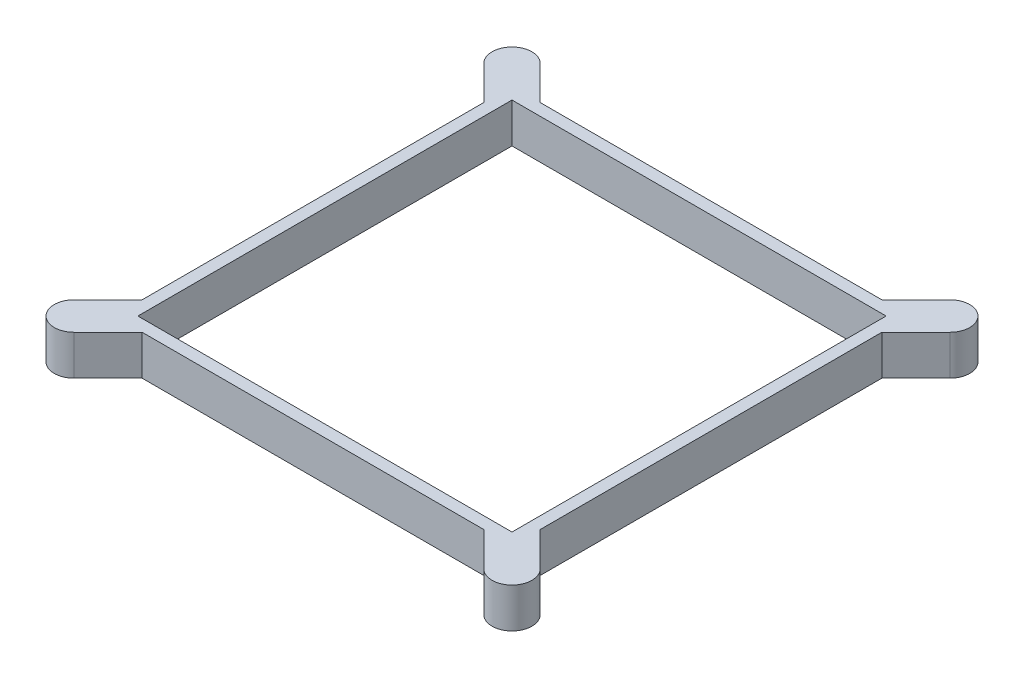
ISO-10303-21;
HEADER;
FILE_DESCRIPTION(('STEP AP214'),'2;1');
FILE_NAME('part.step','',(''),(''),'','','');
FILE_SCHEMA(('AUTOMOTIVE_DESIGN { 1 0 10303 214 1 1 1 1 }'));
ENDSEC;
DATA;
#1=APPLICATION_CONTEXT('core data for automotive mechanical design processes');
#2=APPLICATION_PROTOCOL_DEFINITION('international standard','automotive_design',2000,#1);
#3=PRODUCT_CONTEXT('',#1,'mechanical');
#4=PRODUCT('Part','Part','',(#3));
#5=PRODUCT_RELATED_PRODUCT_CATEGORY('part','',(#4));
#6=PRODUCT_DEFINITION_FORMATION('','',#4);
#7=PRODUCT_DEFINITION_CONTEXT('part definition',#1,'design');
#8=PRODUCT_DEFINITION('design','',#6,#7);
#9=PRODUCT_DEFINITION_SHAPE('','',#8);
#10=(LENGTH_UNIT() NAMED_UNIT(*) SI_UNIT(.MILLI.,.METRE.));
#11=(NAMED_UNIT(*) PLANE_ANGLE_UNIT() SI_UNIT($,.RADIAN.));
#12=(NAMED_UNIT(*) SI_UNIT($,.STERADIAN.) SOLID_ANGLE_UNIT());
#13=UNCERTAINTY_MEASURE_WITH_UNIT(LENGTH_MEASURE(1.E-05),#10,'distance_accuracy_value','');
#14=(GEOMETRIC_REPRESENTATION_CONTEXT(3) GLOBAL_UNCERTAINTY_ASSIGNED_CONTEXT((#13)) GLOBAL_UNIT_ASSIGNED_CONTEXT((#10,
#11,#12)) REPRESENTATION_CONTEXT('',''));
#15=CARTESIAN_POINT('',(0.,0.,0.));
#16=DIRECTION('',(0.,0.,1.));
#17=DIRECTION('',(1.,0.,0.));
#18=AXIS2_PLACEMENT_3D('',#15,#16,#17);
#19=CARTESIAN_POINT('',(200.,20.,0.));
#20=DIRECTION('',(-1.,0.,0.));
#21=DIRECTION('',(0.,0.,1.));
#22=AXIS2_PLACEMENT_3D('',#19,#20,#21);
#23=PLANE('',#22);
#24=DIRECTION('',(0.,-1.,0.));
#25=VECTOR('',#24,1.);
#26=CARTESIAN_POINT('',(200.,68.3076870304613,-185.857864376269));
#27=LINE('',#26,#25);
#28=CARTESIAN_POINT('',(200.,20.,-185.857864376269));
#29=VERTEX_POINT('',#28);
#30=CARTESIAN_POINT('',(200.,0.,-185.857864376269));
#31=VERTEX_POINT('',#30);
#32=EDGE_CURVE('E310',#29,#31,#27,.T.);
#33=ORIENTED_EDGE('',*,*,#32,.F.);
#34=DIRECTION('',(0.,0.,-1.));
#35=VECTOR('',#34,1.);
#36=CARTESIAN_POINT('',(200.,20.,0.));
#37=LINE('',#36,#35);
#38=CARTESIAN_POINT('',(200.,20.,-14.142135623731));
#39=VERTEX_POINT('',#38);
#40=EDGE_CURVE('E72',#39,#29,#37,.T.);
#41=ORIENTED_EDGE('',*,*,#40,.F.);
#42=DIRECTION('',(0.,-1.,0.));
#43=VECTOR('',#42,1.);
#44=CARTESIAN_POINT('',(200.,68.3076870304613,-14.142135623731));
#45=LINE('',#44,#43);
#46=CARTESIAN_POINT('',(200.,0.,-14.142135623731));
#47=VERTEX_POINT('',#46);
#48=EDGE_CURVE('E345',#39,#47,#45,.T.);
#49=ORIENTED_EDGE('',*,*,#48,.T.);
#50=DIRECTION('',(0.,0.,-1.));
#51=VECTOR('',#50,1.);
#52=CARTESIAN_POINT('',(200.,0.,0.));
#53=LINE('',#52,#51);
#54=EDGE_CURVE('E402',#47,#31,#53,.T.);
#55=ORIENTED_EDGE('',*,*,#54,.T.);
#56=EDGE_LOOP('',(#33,#41,#49,#55));
#57=FACE_BOUND('',#56,.T.);
#58=ADVANCED_FACE('F63',(#57),#23,.F.);
#59=CARTESIAN_POINT('',(0.,20.,-200.));
#60=DIRECTION('',(0.,0.,1.));
#61=DIRECTION('',(1.,0.,0.));
#62=AXIS2_PLACEMENT_3D('',#59,#60,#61);
#63=PLANE('',#62);
#64=DIRECTION('',(-1.,0.,0.));
#65=VECTOR('',#64,1.);
#66=CARTESIAN_POINT('',(0.,0.,-200.));
#67=LINE('',#66,#65);
#68=CARTESIAN_POINT('',(185.857864376269,0.,-200.));
#69=VERTEX_POINT('',#68);
#70=CARTESIAN_POINT('',(14.1421356237309,0.,-200.));
#71=VERTEX_POINT('',#70);
#72=EDGE_CURVE('E67',#69,#71,#67,.T.);
#73=ORIENTED_EDGE('',*,*,#72,.T.);
#74=DIRECTION('',(0.,-1.,0.));
#75=VECTOR('',#74,1.);
#76=CARTESIAN_POINT('',(14.142135623731,68.3076870304613,-200.));
#77=LINE('',#76,#75);
#78=CARTESIAN_POINT('',(14.1421356237309,20.,-200.));
#79=VERTEX_POINT('',#78);
#80=EDGE_CURVE('E270',#79,#71,#77,.T.);
#81=ORIENTED_EDGE('',*,*,#80,.F.);
#82=DIRECTION('',(-1.,0.,0.));
#83=VECTOR('',#82,1.);
#84=CARTESIAN_POINT('',(0.,20.,-200.));
#85=LINE('',#84,#83);
#86=CARTESIAN_POINT('',(185.857864376269,20.,-200.));
#87=VERTEX_POINT('',#86);
#88=EDGE_CURVE('E12',#87,#79,#85,.T.);
#89=ORIENTED_EDGE('',*,*,#88,.F.);
#90=DIRECTION('',(0.,-1.,0.));
#91=VECTOR('',#90,1.);
#92=CARTESIAN_POINT('',(185.857864376269,68.3076870304613,-200.));
#93=LINE('',#92,#91);
#94=EDGE_CURVE('E307',#87,#69,#93,.T.);
#95=ORIENTED_EDGE('',*,*,#94,.T.);
#96=EDGE_LOOP('',(#73,#81,#89,#95));
#97=FACE_BOUND('',#96,.T.);
#98=ADVANCED_FACE('F406',(#97),#63,.F.);
#99=CARTESIAN_POINT('',(0.,20.,0.));
#100=DIRECTION('',(1.,0.,0.));
#101=DIRECTION('',(0.,0.,-1.));
#102=AXIS2_PLACEMENT_3D('',#99,#100,#101);
#103=PLANE('',#102);
#104=DIRECTION('',(0.,0.,1.));
#105=VECTOR('',#104,1.);
#106=CARTESIAN_POINT('',(0.,20.,0.));
#107=LINE('',#106,#105);
#108=CARTESIAN_POINT('',(0.,20.,-185.857864376269));
#109=VERTEX_POINT('',#108);
#110=CARTESIAN_POINT('',(0.,20.,-14.142135623731));
#111=VERTEX_POINT('',#110);
#112=EDGE_CURVE('E393',#109,#111,#107,.T.);
#113=ORIENTED_EDGE('',*,*,#112,.F.);
#114=DIRECTION('',(0.,-1.,0.));
#115=VECTOR('',#114,1.);
#116=CARTESIAN_POINT('',(0.,68.3076870304613,-185.857864376269));
#117=LINE('',#116,#115);
#118=CARTESIAN_POINT('',(0.,0.,-185.857864376269));
#119=VERTEX_POINT('',#118);
#120=EDGE_CURVE('E268',#109,#119,#117,.T.);
#121=ORIENTED_EDGE('',*,*,#120,.T.);
#122=DIRECTION('',(0.,0.,1.));
#123=VECTOR('',#122,1.);
#124=CARTESIAN_POINT('',(0.,0.,0.));
#125=LINE('',#124,#123);
#126=CARTESIAN_POINT('',(0.,0.,-14.142135623731));
#127=VERTEX_POINT('',#126);
#128=EDGE_CURVE('E372',#119,#127,#125,.T.);
#129=ORIENTED_EDGE('',*,*,#128,.T.);
#130=DIRECTION('',(0.,-1.,0.));
#131=VECTOR('',#130,1.);
#132=CARTESIAN_POINT('',(0.,68.3076870304613,-14.142135623731));
#133=LINE('',#132,#131);
#134=EDGE_CURVE('E387',#111,#127,#133,.T.);
#135=ORIENTED_EDGE('',*,*,#134,.F.);
#136=EDGE_LOOP('',(#113,#121,#129,#135));
#137=FACE_BOUND('',#136,.T.);
#138=ADVANCED_FACE('F65',(#137),#103,.F.);
#139=CARTESIAN_POINT('',(0.,20.,0.));
#140=DIRECTION('',(0.,0.,-1.));
#141=DIRECTION('',(-1.,0.,0.));
#142=AXIS2_PLACEMENT_3D('',#139,#140,#141);
#143=PLANE('',#142);
#144=DIRECTION('',(1.,0.,0.));
#145=VECTOR('',#144,1.);
#146=CARTESIAN_POINT('',(0.,0.,0.));
#147=LINE('',#146,#145);
#148=CARTESIAN_POINT('',(14.142135623731,0.,0.));
#149=VERTEX_POINT('',#148);
#150=CARTESIAN_POINT('',(185.857864376269,0.,0.));
#151=VERTEX_POINT('',#150);
#152=EDGE_CURVE('E401',#149,#151,#147,.T.);
#153=ORIENTED_EDGE('',*,*,#152,.T.);
#154=DIRECTION('',(0.,-1.,0.));
#155=VECTOR('',#154,1.);
#156=CARTESIAN_POINT('',(185.857864376269,68.3076870304613,0.));
#157=LINE('',#156,#155);
#158=CARTESIAN_POINT('',(185.857864376269,20.,0.));
#159=VERTEX_POINT('',#158);
#160=EDGE_CURVE('E347',#159,#151,#157,.T.);
#161=ORIENTED_EDGE('',*,*,#160,.F.);
#162=DIRECTION('',(1.,0.,0.));
#163=VECTOR('',#162,1.);
#164=CARTESIAN_POINT('',(0.,20.,0.));
#165=LINE('',#164,#163);
#166=CARTESIAN_POINT('',(14.142135623731,20.,0.));
#167=VERTEX_POINT('',#166);
#168=EDGE_CURVE('E395',#167,#159,#165,.T.);
#169=ORIENTED_EDGE('',*,*,#168,.F.);
#170=DIRECTION('',(0.,-1.,0.));
#171=VECTOR('',#170,1.);
#172=CARTESIAN_POINT('',(14.142135623731,68.3076870304613,0.));
#173=LINE('',#172,#171);
#174=EDGE_CURVE('E384',#167,#149,#173,.T.);
#175=ORIENTED_EDGE('',*,*,#174,.T.);
#176=EDGE_LOOP('',(#153,#161,#169,#175));
#177=FACE_BOUND('',#176,.T.);
#178=ADVANCED_FACE('F488',(#177),#143,.F.);
#179=CARTESIAN_POINT('',(0.,20.,0.));
#180=DIRECTION('',(0.,-1.,0.));
#181=DIRECTION('',(0.,0.,-1.));
#182=AXIS2_PLACEMENT_3D('',#179,#180,#181);
#183=PLANE('',#182);
#184=DIRECTION('',(1.,0.,0.));
#185=VECTOR('',#184,1.);
#186=CARTESIAN_POINT('',(5.99999999999999,20.,-194.));
#187=LINE('',#186,#185);
#188=CARTESIAN_POINT('',(5.99999999999999,20.,-194.));
#189=VERTEX_POINT('',#188);
#190=CARTESIAN_POINT('',(194.,20.,-194.));
#191=VERTEX_POINT('',#190);
#192=EDGE_CURVE('E210',#189,#191,#187,.T.);
#193=ORIENTED_EDGE('',*,*,#192,.T.);
#194=DIRECTION('',(0.,0.,1.));
#195=VECTOR('',#194,1.);
#196=CARTESIAN_POINT('',(194.,20.,-194.));
#197=LINE('',#196,#195);
#198=CARTESIAN_POINT('',(194.,20.,-6.));
#199=VERTEX_POINT('',#198);
#200=EDGE_CURVE('E204',#191,#199,#197,.T.);
#201=ORIENTED_EDGE('',*,*,#200,.T.);
#202=DIRECTION('',(-1.,0.,0.));
#203=VECTOR('',#202,1.);
#204=CARTESIAN_POINT('',(6.,20.,-6.));
#205=LINE('',#204,#203);
#206=CARTESIAN_POINT('',(6.,20.,-6.));
#207=VERTEX_POINT('',#206);
#208=EDGE_CURVE('E213',#199,#207,#205,.T.);
#209=ORIENTED_EDGE('',*,*,#208,.T.);
#210=DIRECTION('',(0.,0.,-1.));
#211=VECTOR('',#210,1.);
#212=CARTESIAN_POINT('',(5.99999999999999,20.,-194.));
#213=LINE('',#212,#211);
#214=EDGE_CURVE('E80',#207,#189,#213,.T.);
#215=ORIENTED_EDGE('',*,*,#214,.T.);
#216=EDGE_LOOP('',(#193,#201,#209,#215));
#217=FACE_BOUND('',#216,.T.);
#218=DIRECTION('',(0.707106781186547,0.,0.707106781186548));
#219=VECTOR('',#218,1.);
#220=CARTESIAN_POINT('',(-7.07106781186548,20.,-192.928932188135));
#221=LINE('',#220,#219);
#222=CARTESIAN_POINT('',(-17.0876252708111,20.,-202.94548964708));
#223=VERTEX_POINT('',#222);
#224=EDGE_CURVE('E251',#223,#109,#221,.T.);
#225=ORIENTED_EDGE('',*,*,#224,.T.);
#226=ORIENTED_EDGE('',*,*,#112,.T.);
#227=DIRECTION('',(0.707106781186547,0.,-0.707106781186548));
#228=VECTOR('',#227,1.);
#229=CARTESIAN_POINT('',(-7.07106781186548,20.,-7.07106781186547));
#230=LINE('',#229,#228);
#231=CARTESIAN_POINT('',(-17.0876252708111,20.,2.94548964708019));
#232=VERTEX_POINT('',#231);
#233=EDGE_CURVE('E369',#232,#111,#230,.T.);
#234=ORIENTED_EDGE('',*,*,#233,.F.);
#235=CARTESIAN_POINT('',(-10.0165574589457,20.,10.0165574589457));
#236=DIRECTION('',(0.,-1.,0.));
#237=DIRECTION('',(0.,0.,-1.));
#238=AXIS2_PLACEMENT_3D('',#235,#236,#237);
#239=CIRCLE('',#238,10.);
#240=CARTESIAN_POINT('',(-2.9454896470802,20.,17.0876252708111));
#241=VERTEX_POINT('',#240);
#242=EDGE_CURVE('E368',#241,#232,#239,.T.);
#243=ORIENTED_EDGE('',*,*,#242,.F.);
#244=DIRECTION('',(-0.707106781186548,0.,0.707106781186547));
#245=VECTOR('',#244,1.);
#246=CARTESIAN_POINT('',(7.07106781186548,20.,7.07106781186548));
#247=LINE('',#246,#245);
#248=EDGE_CURVE('E365',#167,#241,#247,.T.);
#249=ORIENTED_EDGE('',*,*,#248,.F.);
#250=ORIENTED_EDGE('',*,*,#168,.T.);
#251=DIRECTION('',(0.707106781186548,0.,0.707106781186547));
#252=VECTOR('',#251,1.);
#253=CARTESIAN_POINT('',(192.928932188135,20.,7.07106781186548));
#254=LINE('',#253,#252);
#255=CARTESIAN_POINT('',(202.94548964708,20.,17.0876252708111));
#256=VERTEX_POINT('',#255);
#257=EDGE_CURVE('E334',#159,#256,#254,.T.);
#258=ORIENTED_EDGE('',*,*,#257,.T.);
#259=CARTESIAN_POINT('',(210.016557458946,20.,10.0165574589457));
#260=DIRECTION('',(0.,-1.,0.));
#261=DIRECTION('',(0.,0.,-1.));
#262=AXIS2_PLACEMENT_3D('',#259,#260,#261);
#263=CIRCLE('',#262,10.);
#264=CARTESIAN_POINT('',(217.087625270811,20.,2.94548964708019));
#265=VERTEX_POINT('',#264);
#266=EDGE_CURVE('E331',#256,#265,#263,.F.);
#267=ORIENTED_EDGE('',*,*,#266,.T.);
#268=DIRECTION('',(-0.707106781186547,0.,-0.707106781186548));
#269=VECTOR('',#268,1.);
#270=CARTESIAN_POINT('',(207.071067811865,20.,-7.07106781186547));
#271=LINE('',#270,#269);
#272=EDGE_CURVE('E328',#265,#39,#271,.T.);
#273=ORIENTED_EDGE('',*,*,#272,.T.);
#274=ORIENTED_EDGE('',*,*,#40,.T.);
#275=DIRECTION('',(-0.707106781186547,0.,0.707106781186548));
#276=VECTOR('',#275,1.);
#277=CARTESIAN_POINT('',(207.071067811865,20.,-192.928932188135));
#278=LINE('',#277,#276);
#279=CARTESIAN_POINT('',(217.087625270811,20.,-202.94548964708));
#280=VERTEX_POINT('',#279);
#281=EDGE_CURVE('E292',#280,#29,#278,.T.);
#282=ORIENTED_EDGE('',*,*,#281,.F.);
#283=CARTESIAN_POINT('',(210.016557458946,20.,-210.016557458946));
#284=DIRECTION('',(0.,-1.,0.));
#285=DIRECTION('',(0.,0.,-1.));
#286=AXIS2_PLACEMENT_3D('',#283,#284,#285);
#287=CIRCLE('',#286,10.);
#288=CARTESIAN_POINT('',(202.94548964708,20.,-217.087625270811));
#289=VERTEX_POINT('',#288);
#290=EDGE_CURVE('E291',#289,#280,#287,.T.);
#291=ORIENTED_EDGE('',*,*,#290,.F.);
#292=DIRECTION('',(0.707106781186548,0.,-0.707106781186547));
#293=VECTOR('',#292,1.);
#294=CARTESIAN_POINT('',(192.928932188135,20.,-207.071067811865));
#295=LINE('',#294,#293);
#296=EDGE_CURVE('E288',#87,#289,#295,.T.);
#297=ORIENTED_EDGE('',*,*,#296,.F.);
#298=ORIENTED_EDGE('',*,*,#88,.T.);
#299=DIRECTION('',(-0.707106781186548,0.,-0.707106781186547));
#300=VECTOR('',#299,1.);
#301=CARTESIAN_POINT('',(7.07106781186548,20.,-207.071067811865));
#302=LINE('',#301,#300);
#303=CARTESIAN_POINT('',(-2.9454896470802,20.,-217.087625270811));
#304=VERTEX_POINT('',#303);
#305=EDGE_CURVE('E257',#79,#304,#302,.T.);
#306=ORIENTED_EDGE('',*,*,#305,.T.);
#307=CARTESIAN_POINT('',(-10.0165574589457,20.,-210.016557458946));
#308=DIRECTION('',(0.,-1.,0.));
#309=DIRECTION('',(0.,0.,-1.));
#310=AXIS2_PLACEMENT_3D('',#307,#308,#309);
#311=CIRCLE('',#310,10.);
#312=EDGE_CURVE('E254',#304,#223,#311,.F.);
#313=ORIENTED_EDGE('',*,*,#312,.T.);
#314=EDGE_LOOP('',(#225,#226,#234,#243,#249,#250,#258,#267,#273,#274,#282,#291,#297,#298,#306,#313));
#315=FACE_BOUND('',#314,.T.);
#316=ADVANCED_FACE('F217',(#217,#315),#183,.F.);
#317=CARTESIAN_POINT('',(0.,0.,0.));
#318=DIRECTION('',(0.,-1.,0.));
#319=DIRECTION('',(0.,0.,-1.));
#320=AXIS2_PLACEMENT_3D('',#317,#318,#319);
#321=PLANE('',#320);
#322=DIRECTION('',(0.,0.,1.));
#323=VECTOR('',#322,1.);
#324=CARTESIAN_POINT('',(194.,0.,-194.));
#325=LINE('',#324,#323);
#326=CARTESIAN_POINT('',(194.,0.,-194.));
#327=VERTEX_POINT('',#326);
#328=CARTESIAN_POINT('',(194.,0.,-6.));
#329=VERTEX_POINT('',#328);
#330=EDGE_CURVE('E88',#327,#329,#325,.T.);
#331=ORIENTED_EDGE('',*,*,#330,.F.);
#332=DIRECTION('',(1.,0.,0.));
#333=VECTOR('',#332,1.);
#334=CARTESIAN_POINT('',(5.99999999999999,0.,-194.));
#335=LINE('',#334,#333);
#336=CARTESIAN_POINT('',(5.99999999999999,0.,-194.));
#337=VERTEX_POINT('',#336);
#338=EDGE_CURVE('E220',#337,#327,#335,.T.);
#339=ORIENTED_EDGE('',*,*,#338,.F.);
#340=DIRECTION('',(0.,0.,-1.));
#341=VECTOR('',#340,1.);
#342=CARTESIAN_POINT('',(5.99999999999999,0.,-194.));
#343=LINE('',#342,#341);
#344=CARTESIAN_POINT('',(6.,0.,-6.));
#345=VERTEX_POINT('',#344);
#346=EDGE_CURVE('E223',#345,#337,#343,.T.);
#347=ORIENTED_EDGE('',*,*,#346,.F.);
#348=DIRECTION('',(-1.,0.,0.));
#349=VECTOR('',#348,1.);
#350=CARTESIAN_POINT('',(6.,0.,-6.));
#351=LINE('',#350,#349);
#352=EDGE_CURVE('E229',#329,#345,#351,.T.);
#353=ORIENTED_EDGE('',*,*,#352,.F.);
#354=EDGE_LOOP('',(#331,#339,#347,#353));
#355=FACE_BOUND('',#354,.T.);
#356=CARTESIAN_POINT('',(-3.41536736099135,0.,-203.415367360991));
#357=DIRECTION('',(0.,1.,0.));
#358=DIRECTION('',(0.,0.,1.));
#359=AXIS2_PLACEMENT_3D('',#356,#357,#358);
#360=CIRCLE('',#359,3.79708670005155);
#361=CARTESIAN_POINT('',(-3.41536736099135,0.,-199.61828066094));
#362=VERTEX_POINT('',#361);
#363=EDGE_CURVE('E235',#362,#362,#360,.T.);
#364=ORIENTED_EDGE('',*,*,#363,.T.);
#365=EDGE_LOOP('',(#364));
#366=FACE_BOUND('',#365,.T.);
#367=CARTESIAN_POINT('',(-10.0165574589457,0.,-210.016557458946));
#368=DIRECTION('',(0.,1.,0.));
#369=DIRECTION('',(0.,0.,1.));
#370=AXIS2_PLACEMENT_3D('',#367,#368,#369);
#371=CIRCLE('',#370,3.79708670005155);
#372=CARTESIAN_POINT('',(-10.0165574589457,0.,-206.219470758894));
#373=VERTEX_POINT('',#372);
#374=EDGE_CURVE('E242',#373,#373,#371,.T.);
#375=ORIENTED_EDGE('',*,*,#374,.T.);
#376=EDGE_LOOP('',(#375));
#377=FACE_BOUND('',#376,.T.);
#378=ORIENTED_EDGE('',*,*,#128,.F.);
#379=DIRECTION('',(-0.707106781186547,0.,-0.707106781186548));
#380=VECTOR('',#379,1.);
#381=CARTESIAN_POINT('',(-7.07106781186548,0.,-192.928932188135));
#382=LINE('',#381,#380);
#383=CARTESIAN_POINT('',(-17.0876252708111,0.,-202.94548964708));
#384=VERTEX_POINT('',#383);
#385=EDGE_CURVE('E263',#119,#384,#382,.T.);
#386=ORIENTED_EDGE('',*,*,#385,.T.);
#387=CARTESIAN_POINT('',(-10.0165574589457,0.,-210.016557458946));
#388=DIRECTION('',(0.,1.,0.));
#389=DIRECTION('',(0.,0.,1.));
#390=AXIS2_PLACEMENT_3D('',#387,#388,#389);
#391=CIRCLE('',#390,10.);
#392=CARTESIAN_POINT('',(-2.9454896470802,0.,-217.087625270811));
#393=VERTEX_POINT('',#392);
#394=EDGE_CURVE('E248',#384,#393,#391,.F.);
#395=ORIENTED_EDGE('',*,*,#394,.T.);
#396=DIRECTION('',(0.707106781186548,0.,0.707106781186547));
#397=VECTOR('',#396,1.);
#398=CARTESIAN_POINT('',(7.07106781186548,0.,-207.071067811865));
#399=LINE('',#398,#397);
#400=EDGE_CURVE('E260',#393,#71,#399,.T.);
#401=ORIENTED_EDGE('',*,*,#400,.T.);
#402=ORIENTED_EDGE('',*,*,#72,.F.);
#403=DIRECTION('',(-0.707106781186548,0.,0.707106781186547));
#404=VECTOR('',#403,1.);
#405=CARTESIAN_POINT('',(192.928932188135,0.,-207.071067811865));
#406=LINE('',#405,#404);
#407=CARTESIAN_POINT('',(202.94548964708,0.,-217.087625270811));
#408=VERTEX_POINT('',#407);
#409=EDGE_CURVE('E301',#408,#69,#406,.T.);
#410=ORIENTED_EDGE('',*,*,#409,.F.);
#411=CARTESIAN_POINT('',(210.016557458946,0.,-210.016557458946));
#412=DIRECTION('',(0.,-1.,0.));
#413=DIRECTION('',(0.,0.,1.));
#414=AXIS2_PLACEMENT_3D('',#411,#412,#413);
#415=CIRCLE('',#414,10.);
#416=CARTESIAN_POINT('',(217.087625270811,0.,-202.94548964708));
#417=VERTEX_POINT('',#416);
#418=EDGE_CURVE('E285',#417,#408,#415,.F.);
#419=ORIENTED_EDGE('',*,*,#418,.F.);
#420=DIRECTION('',(0.707106781186547,0.,-0.707106781186548));
#421=VECTOR('',#420,1.);
#422=CARTESIAN_POINT('',(207.071067811865,0.,-192.928932188135));
#423=LINE('',#422,#421);
#424=EDGE_CURVE('E298',#31,#417,#423,.T.);
#425=ORIENTED_EDGE('',*,*,#424,.F.);
#426=ORIENTED_EDGE('',*,*,#54,.F.);
#427=DIRECTION('',(0.707106781186547,0.,0.707106781186548));
#428=VECTOR('',#427,1.);
#429=CARTESIAN_POINT('',(207.071067811865,0.,-7.07106781186547));
#430=LINE('',#429,#428);
#431=CARTESIAN_POINT('',(217.087625270811,0.,2.94548964708019));
#432=VERTEX_POINT('',#431);
#433=EDGE_CURVE('E340',#47,#432,#430,.T.);
#434=ORIENTED_EDGE('',*,*,#433,.T.);
#435=CARTESIAN_POINT('',(210.016557458946,0.,10.0165574589457));
#436=DIRECTION('',(0.,1.,0.));
#437=DIRECTION('',(0.,0.,-1.));
#438=AXIS2_PLACEMENT_3D('',#435,#436,#437);
#439=CIRCLE('',#438,10.);
#440=CARTESIAN_POINT('',(202.94548964708,0.,17.0876252708111));
#441=VERTEX_POINT('',#440);
#442=EDGE_CURVE('E325',#432,#441,#439,.F.);
#443=ORIENTED_EDGE('',*,*,#442,.T.);
#444=DIRECTION('',(-0.707106781186548,0.,-0.707106781186547));
#445=VECTOR('',#444,1.);
#446=CARTESIAN_POINT('',(192.928932188135,0.,7.07106781186548));
#447=LINE('',#446,#445);
#448=EDGE_CURVE('E337',#441,#151,#447,.T.);
#449=ORIENTED_EDGE('',*,*,#448,.T.);
#450=ORIENTED_EDGE('',*,*,#152,.F.);
#451=DIRECTION('',(0.707106781186548,0.,-0.707106781186547));
#452=VECTOR('',#451,1.);
#453=CARTESIAN_POINT('',(7.07106781186548,0.,7.07106781186548));
#454=LINE('',#453,#452);
#455=CARTESIAN_POINT('',(-2.9454896470802,0.,17.0876252708111));
#456=VERTEX_POINT('',#455);
#457=EDGE_CURVE('E378',#456,#149,#454,.T.);
#458=ORIENTED_EDGE('',*,*,#457,.F.);
#459=CARTESIAN_POINT('',(-10.0165574589457,0.,10.0165574589457));
#460=DIRECTION('',(0.,-1.,0.));
#461=DIRECTION('',(0.,0.,-1.));
#462=AXIS2_PLACEMENT_3D('',#459,#460,#461);
#463=CIRCLE('',#462,10.);
#464=CARTESIAN_POINT('',(-17.0876252708111,0.,2.94548964708019));
#465=VERTEX_POINT('',#464);
#466=EDGE_CURVE('E362',#465,#456,#463,.F.);
#467=ORIENTED_EDGE('',*,*,#466,.F.);
#468=DIRECTION('',(-0.707106781186547,0.,0.707106781186548));
#469=VECTOR('',#468,1.);
#470=CARTESIAN_POINT('',(-7.07106781186548,0.,-7.07106781186547));
#471=LINE('',#470,#469);
#472=EDGE_CURVE('E375',#127,#465,#471,.T.);
#473=ORIENTED_EDGE('',*,*,#472,.F.);
#474=EDGE_LOOP('',(#378,#386,#395,#401,#402,#410,#419,#425,#426,#434,#443,#449,#450,#458,#467,#473));
#475=FACE_BOUND('',#474,.T.);
#476=CARTESIAN_POINT('',(203.415367360991,0.,-203.415367360991));
#477=DIRECTION('',(0.,-1.,0.));
#478=DIRECTION('',(0.,0.,1.));
#479=AXIS2_PLACEMENT_3D('',#476,#477,#478);
#480=CIRCLE('',#479,3.79708670005155);
#481=CARTESIAN_POINT('',(203.415367360991,0.,-199.61828066094));
#482=VERTEX_POINT('',#481);
#483=EDGE_CURVE('E275',#482,#482,#480,.T.);
#484=ORIENTED_EDGE('',*,*,#483,.F.);
#485=EDGE_LOOP('',(#484));
#486=FACE_BOUND('',#485,.T.);
#487=CARTESIAN_POINT('',(210.016557458946,0.,-210.016557458946));
#488=DIRECTION('',(0.,-1.,0.));
#489=DIRECTION('',(0.,0.,1.));
#490=AXIS2_PLACEMENT_3D('',#487,#488,#489);
#491=CIRCLE('',#490,3.79708670005155);
#492=CARTESIAN_POINT('',(210.016557458946,0.,-206.219470758894));
#493=VERTEX_POINT('',#492);
#494=EDGE_CURVE('E279',#493,#493,#491,.T.);
#495=ORIENTED_EDGE('',*,*,#494,.F.);
#496=EDGE_LOOP('',(#495));
#497=FACE_BOUND('',#496,.T.);
#498=CARTESIAN_POINT('',(203.415367360991,0.,3.41536736099135));
#499=DIRECTION('',(0.,1.,0.));
#500=DIRECTION('',(0.,0.,-1.));
#501=AXIS2_PLACEMENT_3D('',#498,#499,#500);
#502=CIRCLE('',#501,3.79708670005155);
#503=CARTESIAN_POINT('',(203.415367360991,0.,-0.381719339060196));
#504=VERTEX_POINT('',#503);
#505=EDGE_CURVE('E295',#504,#504,#502,.T.);
#506=ORIENTED_EDGE('',*,*,#505,.T.);
#507=EDGE_LOOP('',(#506));
#508=FACE_BOUND('',#507,.T.);
#509=CARTESIAN_POINT('',(210.016557458946,0.,10.0165574589457));
#510=DIRECTION('',(0.,1.,0.));
#511=DIRECTION('',(0.,0.,-1.));
#512=AXIS2_PLACEMENT_3D('',#509,#510,#511);
#513=CIRCLE('',#512,3.79708670005155);
#514=CARTESIAN_POINT('',(210.016557458946,0.,6.21947075889412));
#515=VERTEX_POINT('',#514);
#516=EDGE_CURVE('E319',#515,#515,#513,.T.);
#517=ORIENTED_EDGE('',*,*,#516,.T.);
#518=EDGE_LOOP('',(#517));
#519=FACE_BOUND('',#518,.T.);
#520=CARTESIAN_POINT('',(-3.41536736099135,0.,3.41536736099135));
#521=DIRECTION('',(0.,-1.,0.));
#522=DIRECTION('',(0.,0.,-1.));
#523=AXIS2_PLACEMENT_3D('',#520,#521,#522);
#524=CIRCLE('',#523,3.79708670005155);
#525=CARTESIAN_POINT('',(-3.41536736099135,0.,-0.381719339060196));
#526=VERTEX_POINT('',#525);
#527=EDGE_CURVE('E352',#526,#526,#524,.T.);
#528=ORIENTED_EDGE('',*,*,#527,.F.);
#529=EDGE_LOOP('',(#528));
#530=FACE_BOUND('',#529,.T.);
#531=CARTESIAN_POINT('',(-10.0165574589457,0.,10.0165574589457));
#532=DIRECTION('',(0.,-1.,0.));
#533=DIRECTION('',(0.,0.,-1.));
#534=AXIS2_PLACEMENT_3D('',#531,#532,#533);
#535=CIRCLE('',#534,3.79708670005155);
#536=CARTESIAN_POINT('',(-10.0165574589457,0.,6.21947075889412));
#537=VERTEX_POINT('',#536);
#538=EDGE_CURVE('E356',#537,#537,#535,.T.);
#539=ORIENTED_EDGE('',*,*,#538,.F.);
#540=EDGE_LOOP('',(#539));
#541=FACE_BOUND('',#540,.T.);
#542=ADVANCED_FACE('F416',(#355,#366,#377,#475,#486,#497,#508,#519,#530,#541),#321,.T.);
#543=CARTESIAN_POINT('',(-7.07106781186548,68.3076870304613,-7.07106781186547));
#544=DIRECTION('',(0.707106781186548,0.,0.707106781186547));
#545=DIRECTION('',(0.707106781186547,0.,-0.707106781186548));
#546=AXIS2_PLACEMENT_3D('',#543,#544,#545);
#547=PLANE('',#546);
#548=DIRECTION('',(0.,-1.,0.));
#549=VECTOR('',#548,1.);
#550=CARTESIAN_POINT('',(-17.0876252708111,68.3076870304613,2.94548964708019));
#551=LINE('',#550,#549);
#552=EDGE_CURVE('E381',#232,#465,#551,.T.);
#553=ORIENTED_EDGE('',*,*,#552,.F.);
#554=ORIENTED_EDGE('',*,*,#233,.T.);
#555=ORIENTED_EDGE('',*,*,#134,.T.);
#556=ORIENTED_EDGE('',*,*,#472,.T.);
#557=EDGE_LOOP('',(#553,#554,#555,#556));
#558=FACE_BOUND('',#557,.T.);
#559=ADVANCED_FACE('F435',(#558),#547,.F.);
#560=CARTESIAN_POINT('',(7.07106781186548,68.3076870304613,7.07106781186548));
#561=DIRECTION('',(-0.707106781186547,0.,-0.707106781186548));
#562=DIRECTION('',(-0.707106781186548,0.,0.707106781186547));
#563=AXIS2_PLACEMENT_3D('',#560,#561,#562);
#564=PLANE('',#563);
#565=ORIENTED_EDGE('',*,*,#174,.F.);
#566=ORIENTED_EDGE('',*,*,#248,.T.);
#567=DIRECTION('',(0.,-1.,0.));
#568=VECTOR('',#567,1.);
#569=CARTESIAN_POINT('',(-2.9454896470802,68.3076870304613,17.0876252708111));
#570=LINE('',#569,#568);
#571=EDGE_CURVE('E382',#241,#456,#570,.T.);
#572=ORIENTED_EDGE('',*,*,#571,.T.);
#573=ORIENTED_EDGE('',*,*,#457,.T.);
#574=EDGE_LOOP('',(#565,#566,#572,#573));
#575=FACE_BOUND('',#574,.T.);
#576=ADVANCED_FACE('F442',(#575),#564,.F.);
#577=CARTESIAN_POINT('',(-10.0165574589457,68.3076870304613,10.0165574589457));
#578=DIRECTION('',(0.,-1.,0.));
#579=DIRECTION('',(0.,0.,-1.));
#580=AXIS2_PLACEMENT_3D('',#577,#578,#579);
#581=CYLINDRICAL_SURFACE('',#580,10.);
#582=ORIENTED_EDGE('',*,*,#571,.F.);
#583=ORIENTED_EDGE('',*,*,#242,.T.);
#584=ORIENTED_EDGE('',*,*,#552,.T.);
#585=ORIENTED_EDGE('',*,*,#466,.T.);
#586=EDGE_LOOP('',(#582,#583,#584,#585));
#587=FACE_BOUND('',#586,.T.);
#588=ADVANCED_FACE('F439',(#587),#581,.T.);
#589=CARTESIAN_POINT('',(-10.0165574589457,10.,10.0165574589457));
#590=DIRECTION('',(0.,-1.,0.));
#591=DIRECTION('',(0.,0.,-1.));
#592=AXIS2_PLACEMENT_3D('',#589,#590,#591);
#593=CYLINDRICAL_SURFACE('',#592,3.79708670005155);
#594=CARTESIAN_POINT('',(-10.0165574589457,10.,10.0165574589457));
#595=DIRECTION('',(0.,-1.,0.));
#596=DIRECTION('',(0.,0.,-1.));
#597=AXIS2_PLACEMENT_3D('',#594,#595,#596);
#598=CIRCLE('',#597,3.79708670005155);
#599=CARTESIAN_POINT('',(-10.0165574589457,10.,6.21947075889412));
#600=VERTEX_POINT('',#599);
#601=EDGE_CURVE('E359',#600,#600,#598,.T.);
#602=ORIENTED_EDGE('',*,*,#601,.F.);
#603=EDGE_LOOP('',(#602));
#604=FACE_BOUND('',#603,.T.);
#605=ORIENTED_EDGE('',*,*,#538,.T.);
#606=EDGE_LOOP('',(#605));
#607=FACE_BOUND('',#606,.T.);
#608=ADVANCED_FACE('F609',(#604,#607),#593,.F.);
#609=CARTESIAN_POINT('',(0.,10.,0.));
#610=DIRECTION('',(0.,-1.,0.));
#611=DIRECTION('',(0.,0.,-1.));
#612=AXIS2_PLACEMENT_3D('',#609,#610,#611);
#613=PLANE('',#612);
#614=ORIENTED_EDGE('',*,*,#601,.T.);
#615=EDGE_LOOP('',(#614));
#616=FACE_BOUND('',#615,.T.);
#617=ADVANCED_FACE('F599',(#616),#613,.T.);
#618=CARTESIAN_POINT('',(-3.41536736099135,10.,3.41536736099135));
#619=DIRECTION('',(0.,-1.,0.));
#620=DIRECTION('',(0.,0.,-1.));
#621=AXIS2_PLACEMENT_3D('',#618,#619,#620);
#622=CYLINDRICAL_SURFACE('',#621,3.79708670005155);
#623=CARTESIAN_POINT('',(-3.41536736099135,10.,3.41536736099135));
#624=DIRECTION('',(0.,-1.,0.));
#625=DIRECTION('',(0.,0.,-1.));
#626=AXIS2_PLACEMENT_3D('',#623,#624,#625);
#627=CIRCLE('',#626,3.79708670005155);
#628=CARTESIAN_POINT('',(-3.41536736099135,10.,-0.381719339060196));
#629=VERTEX_POINT('',#628);
#630=EDGE_CURVE('E353',#629,#629,#627,.T.);
#631=ORIENTED_EDGE('',*,*,#630,.F.);
#632=EDGE_LOOP('',(#631));
#633=FACE_BOUND('',#632,.T.);
#634=ORIENTED_EDGE('',*,*,#527,.T.);
#635=EDGE_LOOP('',(#634));
#636=FACE_BOUND('',#635,.T.);
#637=ADVANCED_FACE('F588',(#633,#636),#622,.F.);
#638=CARTESIAN_POINT('',(0.,10.,0.));
#639=DIRECTION('',(0.,-1.,0.));
#640=DIRECTION('',(0.,0.,-1.));
#641=AXIS2_PLACEMENT_3D('',#638,#639,#640);
#642=PLANE('',#641);
#643=ORIENTED_EDGE('',*,*,#630,.T.);
#644=EDGE_LOOP('',(#643));
#645=FACE_BOUND('',#644,.T.);
#646=ADVANCED_FACE('F572',(#645),#642,.T.);
#647=CARTESIAN_POINT('',(210.016557458946,68.3076870304613,10.0165574589457));
#648=DIRECTION('',(0.,-1.,0.));
#649=DIRECTION('',(0.,0.,-1.));
#650=AXIS2_PLACEMENT_3D('',#647,#648,#649);
#651=CYLINDRICAL_SURFACE('',#650,10.);
#652=ORIENTED_EDGE('',*,*,#266,.F.);
#653=DIRECTION('',(0.,-1.,0.));
#654=VECTOR('',#653,1.);
#655=CARTESIAN_POINT('',(202.94548964708,68.3076870304613,17.0876252708111));
#656=LINE('',#655,#654);
#657=EDGE_CURVE('E343',#256,#441,#656,.T.);
#658=ORIENTED_EDGE('',*,*,#657,.T.);
#659=ORIENTED_EDGE('',*,*,#442,.F.);
#660=DIRECTION('',(0.,-1.,0.));
#661=VECTOR('',#660,1.);
#662=CARTESIAN_POINT('',(217.087625270811,68.3076870304613,2.94548964708019));
#663=LINE('',#662,#661);
#664=EDGE_CURVE('E332',#265,#432,#663,.T.);
#665=ORIENTED_EDGE('',*,*,#664,.F.);
#666=EDGE_LOOP('',(#652,#658,#659,#665));
#667=FACE_BOUND('',#666,.T.);
#668=ADVANCED_FACE('F452',(#667),#651,.T.);
#669=CARTESIAN_POINT('',(207.071067811865,68.3076870304613,-7.07106781186547));
#670=DIRECTION('',(0.707106781186548,0.,-0.707106781186547));
#671=DIRECTION('',(-0.707106781186547,0.,-0.707106781186548));
#672=AXIS2_PLACEMENT_3D('',#669,#670,#671);
#673=PLANE('',#672);
#674=ORIENTED_EDGE('',*,*,#272,.F.);
#675=ORIENTED_EDGE('',*,*,#664,.T.);
#676=ORIENTED_EDGE('',*,*,#433,.F.);
#677=ORIENTED_EDGE('',*,*,#48,.F.);
#678=EDGE_LOOP('',(#674,#675,#676,#677));
#679=FACE_BOUND('',#678,.T.);
#680=ADVANCED_FACE('F457',(#679),#673,.T.);
#681=CARTESIAN_POINT('',(192.928932188135,68.3076870304613,7.07106781186548));
#682=DIRECTION('',(-0.707106781186547,0.,0.707106781186548));
#683=DIRECTION('',(0.707106781186548,0.,0.707106781186547));
#684=AXIS2_PLACEMENT_3D('',#681,#682,#683);
#685=PLANE('',#684);
#686=ORIENTED_EDGE('',*,*,#257,.F.);
#687=ORIENTED_EDGE('',*,*,#160,.T.);
#688=ORIENTED_EDGE('',*,*,#448,.F.);
#689=ORIENTED_EDGE('',*,*,#657,.F.);
#690=EDGE_LOOP('',(#686,#687,#688,#689));
#691=FACE_BOUND('',#690,.T.);
#692=ADVANCED_FACE('F448',(#691),#685,.T.);
#693=CARTESIAN_POINT('',(210.016557458946,10.,10.0165574589457));
#694=DIRECTION('',(0.,-1.,0.));
#695=DIRECTION('',(0.,0.,-1.));
#696=AXIS2_PLACEMENT_3D('',#693,#694,#695);
#697=CYLINDRICAL_SURFACE('',#696,3.79708670005155);
#698=CARTESIAN_POINT('',(210.016557458946,10.,10.0165574589457));
#699=DIRECTION('',(0.,1.,0.));
#700=DIRECTION('',(0.,0.,-1.));
#701=AXIS2_PLACEMENT_3D('',#698,#699,#700);
#702=CIRCLE('',#701,3.79708670005155);
#703=CARTESIAN_POINT('',(210.016557458946,10.,6.21947075889412));
#704=VERTEX_POINT('',#703);
#705=EDGE_CURVE('E322',#704,#704,#702,.T.);
#706=ORIENTED_EDGE('',*,*,#705,.T.);
#707=EDGE_LOOP('',(#706));
#708=FACE_BOUND('',#707,.T.);
#709=ORIENTED_EDGE('',*,*,#516,.F.);
#710=EDGE_LOOP('',(#709));
#711=FACE_BOUND('',#710,.T.);
#712=ADVANCED_FACE('F536',(#708,#711),#697,.F.);
#713=CARTESIAN_POINT('',(200.,10.,0.));
#714=DIRECTION('',(0.,-1.,0.));
#715=DIRECTION('',(0.,0.,-1.));
#716=AXIS2_PLACEMENT_3D('',#713,#714,#715);
#717=PLANE('',#716);
#718=ORIENTED_EDGE('',*,*,#705,.F.);
#719=EDGE_LOOP('',(#718));
#720=FACE_BOUND('',#719,.T.);
#721=ADVANCED_FACE('F526',(#720),#717,.T.);
#722=CARTESIAN_POINT('',(203.415367360991,10.,3.41536736099135));
#723=DIRECTION('',(0.,-1.,0.));
#724=DIRECTION('',(0.,0.,-1.));
#725=AXIS2_PLACEMENT_3D('',#722,#723,#724);
#726=CYLINDRICAL_SURFACE('',#725,3.79708670005155);
#727=CARTESIAN_POINT('',(203.415367360991,10.,3.41536736099135));
#728=DIRECTION('',(0.,1.,0.));
#729=DIRECTION('',(0.,0.,-1.));
#730=AXIS2_PLACEMENT_3D('',#727,#728,#729);
#731=CIRCLE('',#730,3.79708670005155);
#732=CARTESIAN_POINT('',(203.415367360991,10.,-0.381719339060196));
#733=VERTEX_POINT('',#732);
#734=EDGE_CURVE('E316',#733,#733,#731,.T.);
#735=ORIENTED_EDGE('',*,*,#734,.T.);
#736=EDGE_LOOP('',(#735));
#737=FACE_BOUND('',#736,.T.);
#738=ORIENTED_EDGE('',*,*,#505,.F.);
#739=EDGE_LOOP('',(#738));
#740=FACE_BOUND('',#739,.T.);
#741=ADVANCED_FACE('F516',(#737,#740),#726,.F.);
#742=CARTESIAN_POINT('',(200.,10.,0.));
#743=DIRECTION('',(0.,-1.,0.));
#744=DIRECTION('',(0.,0.,-1.));
#745=AXIS2_PLACEMENT_3D('',#742,#743,#744);
#746=PLANE('',#745);
#747=ORIENTED_EDGE('',*,*,#734,.F.);
#748=EDGE_LOOP('',(#747));
#749=FACE_BOUND('',#748,.T.);
#750=ADVANCED_FACE('F478',(#749),#746,.T.);
#751=CARTESIAN_POINT('',(207.071067811865,68.3076870304613,-192.928932188135));
#752=DIRECTION('',(-0.707106781186548,0.,-0.707106781186547));
#753=DIRECTION('',(-0.707106781186547,0.,0.707106781186548));
#754=AXIS2_PLACEMENT_3D('',#751,#752,#753);
#755=PLANE('',#754);
#756=DIRECTION('',(0.,-1.,0.));
#757=VECTOR('',#756,1.);
#758=CARTESIAN_POINT('',(217.087625270811,68.3076870304613,-202.94548964708));
#759=LINE('',#758,#757);
#760=EDGE_CURVE('E304',#280,#417,#759,.T.);
#761=ORIENTED_EDGE('',*,*,#760,.F.);
#762=ORIENTED_EDGE('',*,*,#281,.T.);
#763=ORIENTED_EDGE('',*,*,#32,.T.);
#764=ORIENTED_EDGE('',*,*,#424,.T.);
#765=EDGE_LOOP('',(#761,#762,#763,#764));
#766=FACE_BOUND('',#765,.T.);
#767=ADVANCED_FACE('F463',(#766),#755,.F.);
#768=CARTESIAN_POINT('',(192.928932188135,68.3076870304613,-207.071067811865));
#769=DIRECTION('',(0.707106781186547,0.,0.707106781186548));
#770=DIRECTION('',(0.707106781186548,0.,-0.707106781186547));
#771=AXIS2_PLACEMENT_3D('',#768,#769,#770);
#772=PLANE('',#771);
#773=ORIENTED_EDGE('',*,*,#94,.F.);
#774=ORIENTED_EDGE('',*,*,#296,.T.);
#775=DIRECTION('',(0.,-1.,0.));
#776=VECTOR('',#775,1.);
#777=CARTESIAN_POINT('',(202.94548964708,68.3076870304613,-217.087625270811));
#778=LINE('',#777,#776);
#779=EDGE_CURVE('E305',#289,#408,#778,.T.);
#780=ORIENTED_EDGE('',*,*,#779,.T.);
#781=ORIENTED_EDGE('',*,*,#409,.T.);
#782=EDGE_LOOP('',(#773,#774,#780,#781));
#783=FACE_BOUND('',#782,.T.);
#784=ADVANCED_FACE('F469',(#783),#772,.F.);
#785=CARTESIAN_POINT('',(210.016557458946,68.3076870304613,-210.016557458946));
#786=DIRECTION('',(0.,-1.,0.));
#787=DIRECTION('',(0.,0.,-1.));
#788=AXIS2_PLACEMENT_3D('',#785,#786,#787);
#789=CYLINDRICAL_SURFACE('',#788,10.);
#790=ORIENTED_EDGE('',*,*,#779,.F.);
#791=ORIENTED_EDGE('',*,*,#290,.T.);
#792=ORIENTED_EDGE('',*,*,#760,.T.);
#793=ORIENTED_EDGE('',*,*,#418,.T.);
#794=EDGE_LOOP('',(#790,#791,#792,#793));
#795=FACE_BOUND('',#794,.T.);
#796=ADVANCED_FACE('F467',(#795),#789,.T.);
#797=CARTESIAN_POINT('',(210.016557458946,10.,-210.016557458946));
#798=DIRECTION('',(0.,-1.,0.));
#799=DIRECTION('',(0.,0.,-1.));
#800=AXIS2_PLACEMENT_3D('',#797,#798,#799);
#801=CYLINDRICAL_SURFACE('',#800,3.79708670005155);
#802=CARTESIAN_POINT('',(210.016557458946,10.,-210.016557458946));
#803=DIRECTION('',(0.,-1.,0.));
#804=DIRECTION('',(0.,0.,1.));
#805=AXIS2_PLACEMENT_3D('',#802,#803,#804);
#806=CIRCLE('',#805,3.79708670005155);
#807=CARTESIAN_POINT('',(210.016557458946,10.,-206.219470758894));
#808=VERTEX_POINT('',#807);
#809=EDGE_CURVE('E282',#808,#808,#806,.T.);
#810=ORIENTED_EDGE('',*,*,#809,.F.);
#811=EDGE_LOOP('',(#810));
#812=FACE_BOUND('',#811,.T.);
#813=ORIENTED_EDGE('',*,*,#494,.T.);
#814=EDGE_LOOP('',(#813));
#815=FACE_BOUND('',#814,.T.);
#816=ADVANCED_FACE('F476',(#812,#815),#801,.F.);
#817=CARTESIAN_POINT('',(200.,10.,-200.));
#818=DIRECTION('',(0.,-1.,0.));
#819=DIRECTION('',(0.,0.,1.));
#820=AXIS2_PLACEMENT_3D('',#817,#818,#819);
#821=PLANE('',#820);
#822=ORIENTED_EDGE('',*,*,#809,.T.);
#823=EDGE_LOOP('',(#822));
#824=FACE_BOUND('',#823,.T.);
#825=ADVANCED_FACE('F747',(#824),#821,.T.);
#826=CARTESIAN_POINT('',(203.415367360991,10.,-203.415367360991));
#827=DIRECTION('',(0.,-1.,0.));
#828=DIRECTION('',(0.,0.,-1.));
#829=AXIS2_PLACEMENT_3D('',#826,#827,#828);
#830=CYLINDRICAL_SURFACE('',#829,3.79708670005155);
#831=CARTESIAN_POINT('',(203.415367360991,10.,-203.415367360991));
#832=DIRECTION('',(0.,-1.,0.));
#833=DIRECTION('',(0.,0.,1.));
#834=AXIS2_PLACEMENT_3D('',#831,#832,#833);
#835=CIRCLE('',#834,3.79708670005155);
#836=CARTESIAN_POINT('',(203.415367360991,10.,-199.61828066094));
#837=VERTEX_POINT('',#836);
#838=EDGE_CURVE('E276',#837,#837,#835,.T.);
#839=ORIENTED_EDGE('',*,*,#838,.F.);
#840=EDGE_LOOP('',(#839));
#841=FACE_BOUND('',#840,.T.);
#842=ORIENTED_EDGE('',*,*,#483,.T.);
#843=EDGE_LOOP('',(#842));
#844=FACE_BOUND('',#843,.T.);
#845=ADVANCED_FACE('F737',(#841,#844),#830,.F.);
#846=CARTESIAN_POINT('',(200.,10.,-200.));
#847=DIRECTION('',(0.,-1.,0.));
#848=DIRECTION('',(0.,0.,1.));
#849=AXIS2_PLACEMENT_3D('',#846,#847,#848);
#850=PLANE('',#849);
#851=ORIENTED_EDGE('',*,*,#838,.T.);
#852=EDGE_LOOP('',(#851));
#853=FACE_BOUND('',#852,.T.);
#854=ADVANCED_FACE('F728',(#853),#850,.T.);
#855=CARTESIAN_POINT('',(-10.0165574589457,68.3076870304613,-210.016557458946));
#856=DIRECTION('',(0.,-1.,0.));
#857=DIRECTION('',(0.,0.,-1.));
#858=AXIS2_PLACEMENT_3D('',#855,#856,#857);
#859=CYLINDRICAL_SURFACE('',#858,10.);
#860=ORIENTED_EDGE('',*,*,#312,.F.);
#861=DIRECTION('',(0.,-1.,0.));
#862=VECTOR('',#861,1.);
#863=CARTESIAN_POINT('',(-2.9454896470802,68.3076870304613,-217.087625270811));
#864=LINE('',#863,#862);
#865=EDGE_CURVE('E266',#304,#393,#864,.T.);
#866=ORIENTED_EDGE('',*,*,#865,.T.);
#867=ORIENTED_EDGE('',*,*,#394,.F.);
#868=DIRECTION('',(0.,-1.,0.));
#869=VECTOR('',#868,1.);
#870=CARTESIAN_POINT('',(-17.0876252708111,68.3076870304613,-202.94548964708));
#871=LINE('',#870,#869);
#872=EDGE_CURVE('E255',#223,#384,#871,.T.);
#873=ORIENTED_EDGE('',*,*,#872,.F.);
#874=EDGE_LOOP('',(#860,#866,#867,#873));
#875=FACE_BOUND('',#874,.T.);
#876=ADVANCED_FACE('F423',(#875),#859,.T.);
#877=CARTESIAN_POINT('',(-7.07106781186548,68.3076870304613,-192.928932188135));
#878=DIRECTION('',(-0.707106781186548,0.,0.707106781186547));
#879=DIRECTION('',(0.707106781186547,0.,0.707106781186548));
#880=AXIS2_PLACEMENT_3D('',#877,#878,#879);
#881=PLANE('',#880);
#882=ORIENTED_EDGE('',*,*,#224,.F.);
#883=ORIENTED_EDGE('',*,*,#872,.T.);
#884=ORIENTED_EDGE('',*,*,#385,.F.);
#885=ORIENTED_EDGE('',*,*,#120,.F.);
#886=EDGE_LOOP('',(#882,#883,#884,#885));
#887=FACE_BOUND('',#886,.T.);
#888=ADVANCED_FACE('F427',(#887),#881,.T.);
#889=CARTESIAN_POINT('',(7.07106781186548,68.3076870304613,-207.071067811865));
#890=DIRECTION('',(0.707106781186547,0.,-0.707106781186548));
#891=DIRECTION('',(-0.707106781186548,0.,-0.707106781186547));
#892=AXIS2_PLACEMENT_3D('',#889,#890,#891);
#893=PLANE('',#892);
#894=ORIENTED_EDGE('',*,*,#305,.F.);
#895=ORIENTED_EDGE('',*,*,#80,.T.);
#896=ORIENTED_EDGE('',*,*,#400,.F.);
#897=ORIENTED_EDGE('',*,*,#865,.F.);
#898=EDGE_LOOP('',(#894,#895,#896,#897));
#899=FACE_BOUND('',#898,.T.);
#900=ADVANCED_FACE('F413',(#899),#893,.T.);
#901=CARTESIAN_POINT('',(-10.0165574589457,10.,-210.016557458946));
#902=DIRECTION('',(0.,-1.,0.));
#903=DIRECTION('',(0.,0.,-1.));
#904=AXIS2_PLACEMENT_3D('',#901,#902,#903);
#905=CYLINDRICAL_SURFACE('',#904,3.79708670005155);
#906=CARTESIAN_POINT('',(-10.0165574589457,10.,-210.016557458946));
#907=DIRECTION('',(0.,1.,0.));
#908=DIRECTION('',(0.,0.,1.));
#909=AXIS2_PLACEMENT_3D('',#906,#907,#908);
#910=CIRCLE('',#909,3.79708670005155);
#911=CARTESIAN_POINT('',(-10.0165574589457,10.,-206.219470758894));
#912=VERTEX_POINT('',#911);
#913=EDGE_CURVE('E245',#912,#912,#910,.T.);
#914=ORIENTED_EDGE('',*,*,#913,.T.);
#915=EDGE_LOOP('',(#914));
#916=FACE_BOUND('',#915,.T.);
#917=ORIENTED_EDGE('',*,*,#374,.F.);
#918=EDGE_LOOP('',(#917));
#919=FACE_BOUND('',#918,.T.);
#920=ADVANCED_FACE('F691',(#916,#919),#905,.F.);
#921=CARTESIAN_POINT('',(0.,10.,-200.));
#922=DIRECTION('',(0.,-1.,0.));
#923=DIRECTION('',(0.,0.,1.));
#924=AXIS2_PLACEMENT_3D('',#921,#922,#923);
#925=PLANE('',#924);
#926=ORIENTED_EDGE('',*,*,#913,.F.);
#927=EDGE_LOOP('',(#926));
#928=FACE_BOUND('',#927,.T.);
#929=ADVANCED_FACE('F681',(#928),#925,.T.);
#930=CARTESIAN_POINT('',(-3.41536736099135,10.,-203.415367360991));
#931=DIRECTION('',(0.,-1.,0.));
#932=DIRECTION('',(0.,0.,-1.));
#933=AXIS2_PLACEMENT_3D('',#930,#931,#932);
#934=CYLINDRICAL_SURFACE('',#933,3.79708670005155);
#935=CARTESIAN_POINT('',(-3.41536736099135,10.,-203.415367360991));
#936=DIRECTION('',(0.,1.,0.));
#937=DIRECTION('',(0.,0.,1.));
#938=AXIS2_PLACEMENT_3D('',#935,#936,#937);
#939=CIRCLE('',#938,3.79708670005155);
#940=CARTESIAN_POINT('',(-3.41536736099135,10.,-199.61828066094));
#941=VERTEX_POINT('',#940);
#942=EDGE_CURVE('E239',#941,#941,#939,.T.);
#943=ORIENTED_EDGE('',*,*,#942,.T.);
#944=EDGE_LOOP('',(#943));
#945=FACE_BOUND('',#944,.T.);
#946=ORIENTED_EDGE('',*,*,#363,.F.);
#947=EDGE_LOOP('',(#946));
#948=FACE_BOUND('',#947,.T.);
#949=ADVANCED_FACE('F669',(#945,#948),#934,.F.);
#950=CARTESIAN_POINT('',(0.,10.,-200.));
#951=DIRECTION('',(0.,-1.,0.));
#952=DIRECTION('',(0.,0.,1.));
#953=AXIS2_PLACEMENT_3D('',#950,#951,#952);
#954=PLANE('',#953);
#955=ORIENTED_EDGE('',*,*,#942,.F.);
#956=EDGE_LOOP('',(#955));
#957=FACE_BOUND('',#956,.T.);
#958=ADVANCED_FACE('F664',(#957),#954,.T.);
#959=CARTESIAN_POINT('',(194.,20.,-194.));
#960=DIRECTION('',(1.,0.,0.));
#961=DIRECTION('',(0.,0.,-1.));
#962=AXIS2_PLACEMENT_3D('',#959,#960,#961);
#963=PLANE('',#962);
#964=ORIENTED_EDGE('',*,*,#330,.T.);
#965=DIRECTION('',(0.,-1.,0.));
#966=VECTOR('',#965,1.);
#967=CARTESIAN_POINT('',(194.,20.,-6.));
#968=LINE('',#967,#966);
#969=EDGE_CURVE('E200',#199,#329,#968,.T.);
#970=ORIENTED_EDGE('',*,*,#969,.F.);
#971=ORIENTED_EDGE('',*,*,#200,.F.);
#972=DIRECTION('',(0.,-1.,0.));
#973=VECTOR('',#972,1.);
#974=CARTESIAN_POINT('',(194.,20.,-194.));
#975=LINE('',#974,#973);
#976=EDGE_CURVE('E233',#191,#327,#975,.T.);
#977=ORIENTED_EDGE('',*,*,#976,.T.);
#978=EDGE_LOOP('',(#964,#970,#971,#977));
#979=FACE_BOUND('',#978,.T.);
#980=ADVANCED_FACE('F202',(#979),#963,.F.);
#981=CARTESIAN_POINT('',(5.99999999999999,20.,-194.));
#982=DIRECTION('',(0.,0.,-1.));
#983=DIRECTION('',(-1.,0.,0.));
#984=AXIS2_PLACEMENT_3D('',#981,#982,#983);
#985=PLANE('',#984);
#986=ORIENTED_EDGE('',*,*,#338,.T.);
#987=ORIENTED_EDGE('',*,*,#976,.F.);
#988=ORIENTED_EDGE('',*,*,#192,.F.);
#989=DIRECTION('',(0.,-1.,0.));
#990=VECTOR('',#989,1.);
#991=CARTESIAN_POINT('',(5.99999999999999,20.,-194.));
#992=LINE('',#991,#990);
#993=EDGE_CURVE('E236',#189,#337,#992,.T.);
#994=ORIENTED_EDGE('',*,*,#993,.T.);
#995=EDGE_LOOP('',(#986,#987,#988,#994));
#996=FACE_BOUND('',#995,.T.);
#997=ADVANCED_FACE('F819',(#996),#985,.F.);
#998=CARTESIAN_POINT('',(5.99999999999999,20.,-194.));
#999=DIRECTION('',(-1.,0.,0.));
#1000=DIRECTION('',(0.,0.,1.));
#1001=AXIS2_PLACEMENT_3D('',#998,#999,#1000);
#1002=PLANE('',#1001);
#1003=ORIENTED_EDGE('',*,*,#346,.T.);
#1004=ORIENTED_EDGE('',*,*,#993,.F.);
#1005=ORIENTED_EDGE('',*,*,#214,.F.);
#1006=DIRECTION('',(0.,-1.,0.));
#1007=VECTOR('',#1006,1.);
#1008=CARTESIAN_POINT('',(6.,20.,-6.));
#1009=LINE('',#1008,#1007);
#1010=EDGE_CURVE('E209',#207,#345,#1009,.T.);
#1011=ORIENTED_EDGE('',*,*,#1010,.T.);
#1012=EDGE_LOOP('',(#1003,#1004,#1005,#1011));
#1013=FACE_BOUND('',#1012,.T.);
#1014=ADVANCED_FACE('F822',(#1013),#1002,.F.);
#1015=CARTESIAN_POINT('',(6.,20.,-6.));
#1016=DIRECTION('',(0.,0.,1.));
#1017=DIRECTION('',(1.,0.,0.));
#1018=AXIS2_PLACEMENT_3D('',#1015,#1016,#1017);
#1019=PLANE('',#1018);
#1020=ORIENTED_EDGE('',*,*,#352,.T.);
#1021=ORIENTED_EDGE('',*,*,#1010,.F.);
#1022=ORIENTED_EDGE('',*,*,#208,.F.);
#1023=ORIENTED_EDGE('',*,*,#969,.T.);
#1024=EDGE_LOOP('',(#1020,#1021,#1022,#1023));
#1025=FACE_BOUND('',#1024,.T.);
#1026=ADVANCED_FACE('F214',(#1025),#1019,.F.);
#1027=CLOSED_SHELL('',(#58,#98,#138,#178,#316,#542,#559,#576,#588,#608,#617,#637,#646,#668,#680,
#692,#712,#721,#741,#750,#767,#784,#796,#816,#825,#845,#854,#876,#888,#900,#920,#929,#949,#958,
#980,#997,#1014,#1026));
#1028=MANIFOLD_SOLID_BREP('B2',#1027);
#1029=ADVANCED_BREP_SHAPE_REPRESENTATION('',(#18,#1028),#14);
#1030=SHAPE_DEFINITION_REPRESENTATION(#9,#1029);
ENDSEC;
END-ISO-10303-21;
